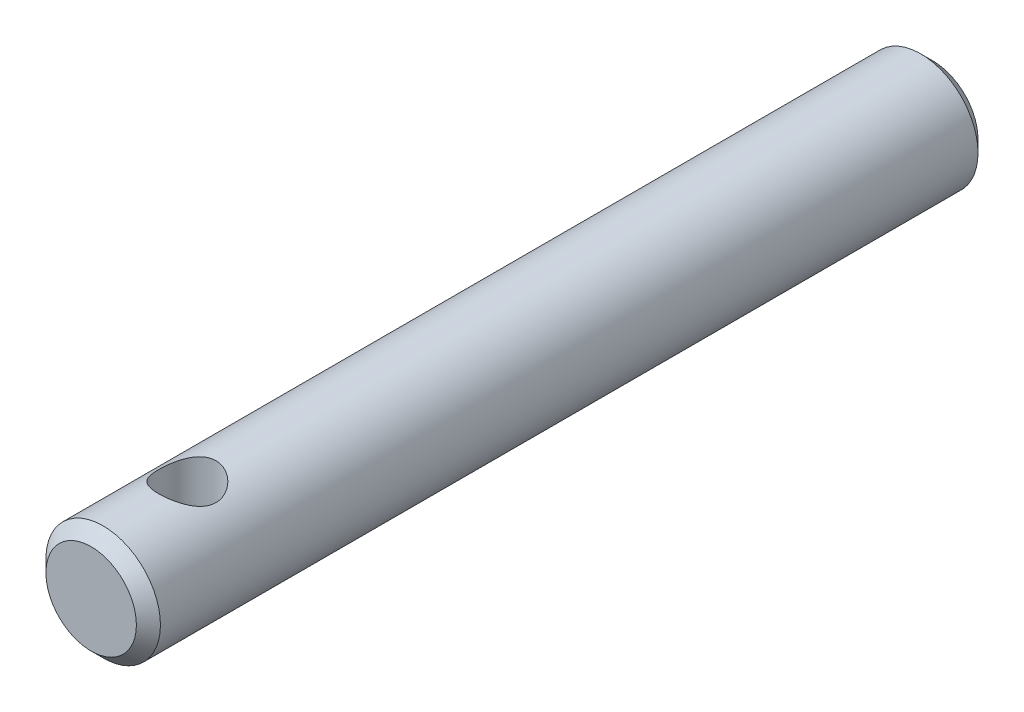
ISO-10303-21;
HEADER;
FILE_DESCRIPTION(('STEP AP214'),'2;1');
FILE_NAME('part.step','',(''),(''),'','','');
FILE_SCHEMA(('AUTOMOTIVE_DESIGN { 1 0 10303 214 1 1 1 1 }'));
ENDSEC;
DATA;
#1=APPLICATION_CONTEXT('core data for automotive mechanical design processes');
#2=APPLICATION_PROTOCOL_DEFINITION('international standard','automotive_design',2000,#1);
#3=PRODUCT_CONTEXT('',#1,'mechanical');
#4=PRODUCT('Part','Part','',(#3));
#5=PRODUCT_RELATED_PRODUCT_CATEGORY('part','',(#4));
#6=PRODUCT_DEFINITION_FORMATION('','',#4);
#7=PRODUCT_DEFINITION_CONTEXT('part definition',#1,'design');
#8=PRODUCT_DEFINITION('design','',#6,#7);
#9=PRODUCT_DEFINITION_SHAPE('','',#8);
#10=(LENGTH_UNIT() NAMED_UNIT(*) SI_UNIT(.MILLI.,.METRE.));
#11=(NAMED_UNIT(*) PLANE_ANGLE_UNIT() SI_UNIT($,.RADIAN.));
#12=(NAMED_UNIT(*) SI_UNIT($,.STERADIAN.) SOLID_ANGLE_UNIT());
#13=UNCERTAINTY_MEASURE_WITH_UNIT(LENGTH_MEASURE(1.E-05),#10,'distance_accuracy_value','');
#14=(GEOMETRIC_REPRESENTATION_CONTEXT(3) GLOBAL_UNCERTAINTY_ASSIGNED_CONTEXT((#13)) GLOBAL_UNIT_ASSIGNED_CONTEXT((#10,
#11,#12)) REPRESENTATION_CONTEXT('',''));
#15=CARTESIAN_POINT('',(0.,0.,0.));
#16=DIRECTION('',(0.,0.,1.));
#17=DIRECTION('',(1.,0.,0.));
#18=AXIS2_PLACEMENT_3D('',#15,#16,#17);
#19=CARTESIAN_POINT('',(0.,0.,17.5));
#20=DIRECTION('',(0.,0.,-1.));
#21=DIRECTION('',(-1.,0.,0.));
#22=AXIS2_PLACEMENT_3D('',#19,#20,#21);
#23=CYLINDRICAL_SURFACE('',#22,2.38125);
#24=CARTESIAN_POINT('',(0.,0.,-17.));
#25=DIRECTION('',(0.,0.,1.));
#26=DIRECTION('',(1.,0.,0.));
#27=AXIS2_PLACEMENT_3D('',#24,#25,#26);
#28=CIRCLE('',#27,2.38125);
#29=CARTESIAN_POINT('',(2.38125,0.,-17.));
#30=VERTEX_POINT('',#29);
#31=EDGE_CURVE('E42',#30,#30,#28,.T.);
#32=ORIENTED_EDGE('',*,*,#31,.T.);
#33=EDGE_LOOP('',(#32));
#34=FACE_BOUND('',#33,.T.);
#35=CARTESIAN_POINT('',(0.,0.,17.));
#36=DIRECTION('',(0.,0.,1.));
#37=DIRECTION('',(1.,0.,0.));
#38=AXIS2_PLACEMENT_3D('',#35,#36,#37);
#39=CIRCLE('',#38,2.38125);
#40=CARTESIAN_POINT('',(2.38125,0.,17.));
#41=VERTEX_POINT('',#40);
#42=EDGE_CURVE('E46',#41,#41,#39,.F.);
#43=ORIENTED_EDGE('',*,*,#42,.T.);
#44=EDGE_LOOP('',(#43));
#45=FACE_BOUND('',#44,.T.);
#46=CARTESIAN_POINT('',(0.,-2.38125,14.690625));
#47=CARTESIAN_POINT('',(0.0625934933908994,-2.38124658771817,14.6906210681758));
#48=CARTESIAN_POINT('',(0.12526160776547,-2.37875553370113,14.6856600066895));
#49=CARTESIAN_POINT('',(0.248745655116468,-2.36903604532025,14.6660351643441));
#50=CARTESIAN_POINT('',(0.309557840743265,-2.36179861446384,14.6513529570872));
#51=CARTESIAN_POINT('',(0.427355251873435,-2.34334382664568,14.6130036216156));
#52=CARTESIAN_POINT('',(0.484354349749463,-2.33214194770735,14.5893714112547));
#53=CARTESIAN_POINT('',(0.593493959385318,-2.30678565164099,14.5339737289374));
#54=CARTESIAN_POINT('',(0.645634853781904,-2.29263146732422,14.5022088982537));
#55=CARTESIAN_POINT('',(0.747126495522785,-2.26166669988499,14.4292622748316));
#56=CARTESIAN_POINT('',(0.796117610742265,-2.24474721461222,14.3876270356553));
#57=CARTESIAN_POINT('',(0.886753026544745,-2.2105140207503,14.2970978637715));
#58=CARTESIAN_POINT('',(0.928391728636494,-2.19320002298882,14.2481984514834));
#59=CARTESIAN_POINT('',(1.00637816303611,-2.15859063769342,14.1399807619737));
#60=CARTESIAN_POINT('',(1.04206516514117,-2.14140081986313,14.0801485829069));
#61=CARTESIAN_POINT('',(1.10271904514173,-2.11081118475794,13.9543813905914));
#62=CARTESIAN_POINT('',(1.12769358094429,-2.09740866244572,13.8884507779895));
#63=CARTESIAN_POINT('',(1.16458893898079,-2.07713897941891,13.756383108857));
#64=CARTESIAN_POINT('',(1.1772017235864,-2.06992860854359,13.6904946992573));
#65=CARTESIAN_POINT('',(1.19113338890835,-2.06194687719966,13.5571751962688));
#66=CARTESIAN_POINT('',(1.19246343021919,-2.06116915374353,13.4897456935253));
#67=CARTESIAN_POINT('',(1.18429955128951,-2.06586451337537,13.3639282022995));
#68=CARTESIAN_POINT('',(1.17608099119853,-2.07060121735085,13.3054232628251));
#69=CARTESIAN_POINT('',(1.15126275778341,-2.08450134836241,13.1907686016527));
#70=CARTESIAN_POINT('',(1.13466041470314,-2.09366618546584,13.1346196363709));
#71=CARTESIAN_POINT('',(1.09324351977209,-2.1155915160392,13.024667814039));
#72=CARTESIAN_POINT('',(1.06824668928498,-2.12843079040573,12.9709500689457));
#73=CARTESIAN_POINT('',(1.01089025937972,-2.15626240722546,12.868213545385));
#74=CARTESIAN_POINT('',(0.97852735278922,-2.17125571566415,12.8191968916761));
#75=CARTESIAN_POINT('',(0.90257239663054,-2.204003536286,12.7207106334526));
#76=CARTESIAN_POINT('',(0.858076839495927,-2.22186710625626,12.6719716598984));
#77=CARTESIAN_POINT('',(0.761470860938949,-2.25680138992047,12.5823431422402));
#78=CARTESIAN_POINT('',(0.709356821108759,-2.27387172175947,12.5414573494847));
#79=CARTESIAN_POINT('',(0.595927464756045,-2.30626428608779,12.4669117598365));
#80=CARTESIAN_POINT('',(0.534297244998046,-2.3214685301789,12.4336756874943));
#81=CARTESIAN_POINT('',(0.405367587816349,-2.34741102209979,12.3783157247957));
#82=CARTESIAN_POINT('',(0.338072701740845,-2.35815281492167,12.3561830109663));
#83=CARTESIAN_POINT('',(0.205700104133523,-2.37320534860897,12.3254777224498));
#84=CARTESIAN_POINT('',(0.140900384809099,-2.37797504664999,12.315933872439));
#85=CARTESIAN_POINT('',(0.0104532111896996,-2.38211931649743,12.307631054493));
#86=CARTESIAN_POINT('',(-0.0551938267826011,-2.38149644415063,12.3088669774105));
#87=CARTESIAN_POINT('',(-0.180061757270824,-2.37519200776753,12.3215273383986));
#88=CARTESIAN_POINT('',(-0.239386357709477,-2.36990626897501,12.3321546717817));
#89=CARTESIAN_POINT('',(-0.35529070614697,-2.35532022721706,12.3620459543501));
#90=CARTESIAN_POINT('',(-0.411870150775843,-2.34601948166815,12.3813108556835));
#91=CARTESIAN_POINT('',(-0.522551749435383,-2.323912493394,12.428435674097));
#92=CARTESIAN_POINT('',(-0.576536816435453,-2.31101362357334,12.4565255940453));
#93=CARTESIAN_POINT('',(-0.679205558772779,-2.28295169421308,12.5202436596286));
#94=CARTESIAN_POINT('',(-0.727886962326195,-2.26778767095513,12.5558750165003));
#95=CARTESIAN_POINT('',(-0.823635905061684,-2.23490101029919,12.637702256412));
#96=CARTESIAN_POINT('',(-0.870075505159961,-2.21707334772676,12.6845919777525));
#97=CARTESIAN_POINT('',(-0.954710182325451,-2.18196785003363,12.78553588323));
#98=CARTESIAN_POINT('',(-0.992899556088158,-2.1646904022613,12.8395949820907));
#99=CARTESIAN_POINT('',(-1.06168973569882,-2.13182825744162,12.9566507257822));
#100=CARTESIAN_POINT('',(-1.0918334810305,-2.11636605630571,13.0199534138296));
#101=CARTESIAN_POINT('',(-1.14071736472268,-2.090428799133,13.1517541743464));
#102=CARTESIAN_POINT('',(-1.15947219672864,-2.07994732092736,13.2202454237405));
#103=CARTESIAN_POINT('',(-1.18331657161977,-2.06646662138444,13.3534462340944));
#104=CARTESIAN_POINT('',(-1.18954509883978,-2.06284572182647,13.4178876579889));
#105=CARTESIAN_POINT('',(-1.19144552443462,-2.06175000375602,13.5469666643501));
#106=CARTESIAN_POINT('',(-1.18712199863718,-2.06427252119055,13.6116041496554));
#107=CARTESIAN_POINT('',(-1.16910579328329,-2.07451954503311,13.7327475440116));
#108=CARTESIAN_POINT('',(-1.1563448992644,-2.081725593681,13.7894414972657));
#109=CARTESIAN_POINT('',(-1.12296816088622,-2.09991741148739,13.89982154219));
#110=CARTESIAN_POINT('',(-1.10234978978715,-2.11090439637645,13.9535066599283));
#111=CARTESIAN_POINT('',(-1.05229312174863,-2.13632093965266,14.0603377132059));
#112=CARTESIAN_POINT('',(-1.02235532346272,-2.15093219477965,14.113205095616));
#113=CARTESIAN_POINT('',(-0.955061000604868,-2.18164566727434,14.21351124464));
#114=CARTESIAN_POINT('',(-0.917700616381016,-2.19774865799103,14.2609471666486));
#115=CARTESIAN_POINT('',(-0.831298335810088,-2.23197328511557,14.3550377977445));
#116=CARTESIAN_POINT('',(-0.781388641146484,-2.25010245755217,14.4008972437497));
#117=CARTESIAN_POINT('',(-0.67407806615602,-2.28454448778714,14.4837693646388));
#118=CARTESIAN_POINT('',(-0.616673173627609,-2.30085636405198,14.5207772710044));
#119=CARTESIAN_POINT('',(-0.495218557463749,-2.33002942662264,14.5849407944138));
#120=CARTESIAN_POINT('',(-0.43112472187215,-2.34286539970214,14.6120249017055));
#121=CARTESIAN_POINT('',(-0.298539814353396,-2.36340659560876,14.6546778499285));
#122=CARTESIAN_POINT('',(-0.230061848926332,-2.37112639390897,14.6702794176315));
#123=CARTESIAN_POINT('',(-0.134066692531779,-2.37762409336193,14.6833591050622));
#124=CARTESIAN_POINT('',(-0.107348987707653,-2.37898025606987,14.6860799567782));
#125=CARTESIAN_POINT('',(-0.0537587806828968,-2.3807939546427,14.6897137736309));
#126=CARTESIAN_POINT('',(-0.0268862742301633,-2.38125146570418,14.6906266888673));
#127=CARTESIAN_POINT('',(0.,-2.38125,14.690625));
#128=B_SPLINE_CURVE_WITH_KNOTS('',3,(#46,#47,#48,#49,#50,#51,#52,#53,#54,#55,#56,#57,#58,#59,
#60,#61,#62,#63,#64,#65,#66,#67,#68,#69,#70,#71,#72,#73,#74,#75,#76,#77,#78,#79,#80,#81,#82,#83,
#84,#85,#86,#87,#88,#89,#90,#91,#92,#93,#94,#95,#96,#97,#98,#99,#100,#101,#102,#103,#104,#105,
#106,#107,#108,#109,#110,#111,#112,#113,#114,#115,#116,#117,#118,#119,#120,#121,#122,#123,#124,
#125,#126,#127),.UNSPECIFIED.,.T.,.F.,(4,2,2,2,2,2,2,2,2,2,2,2,2,2,2,2,2,2,2,2,2,2,2,2,2,2,2,2,
2,2,2,2,2,2,2,2,2,2,2,2,4),(0.,0.187671381491035,0.375699515747514,0.56300150388302,
0.75028872744243,0.948906406473724,1.14767467670684,1.36185743031615,1.57588681716391,
1.77710320704461,1.97812053569865,2.15509926337347,2.33213438424011,2.51329317200605,
2.69453345625451,2.89875445775649,3.10307277131561,3.31687910824068,3.53051527011183,
3.72645730217446,3.92230647121476,4.10297598058852,4.28366541066828,4.46952119208217,
4.65545627297242,4.85965036423511,5.06398516445249,5.27821543446362,5.49216872029489,
5.68558331740251,5.87891405645819,6.0538272319698,6.22879670208067,6.41552156348466,
6.60234377481072,6.81186617152194,7.02150118957732,7.2326184126742,7.44313156831557,
7.52374130413946,7.60435326481739),.UNSPECIFIED.);
#129=CARTESIAN_POINT('',(0.,-2.38125,14.690625));
#130=VERTEX_POINT('',#129);
#131=EDGE_CURVE('E51',#130,#130,#128,.T.);
#132=ORIENTED_EDGE('',*,*,#131,.T.);
#133=EDGE_LOOP('',(#132));
#134=FACE_BOUND('',#133,.T.);
#135=CARTESIAN_POINT('',(0.,2.38125,14.690625));
#136=CARTESIAN_POINT('',(-0.0625934933908994,2.38124658771817,14.6906210681758));
#137=CARTESIAN_POINT('',(-0.12526160776547,2.37875553370113,14.6856600066895));
#138=CARTESIAN_POINT('',(-0.248745655116468,2.36903604532025,14.6660351643441));
#139=CARTESIAN_POINT('',(-0.309557840743265,2.36179861446384,14.6513529570872));
#140=CARTESIAN_POINT('',(-0.427355251873435,2.34334382664568,14.6130036216156));
#141=CARTESIAN_POINT('',(-0.484354349749463,2.33214194770735,14.5893714112547));
#142=CARTESIAN_POINT('',(-0.593493959385318,2.30678565164099,14.5339737289374));
#143=CARTESIAN_POINT('',(-0.645634853781904,2.29263146732422,14.5022088982537));
#144=CARTESIAN_POINT('',(-0.747126495522785,2.26166669988499,14.4292622748316));
#145=CARTESIAN_POINT('',(-0.796117610742265,2.24474721461222,14.3876270356553));
#146=CARTESIAN_POINT('',(-0.886753026544745,2.2105140207503,14.2970978637715));
#147=CARTESIAN_POINT('',(-0.928391728636494,2.19320002298882,14.2481984514834));
#148=CARTESIAN_POINT('',(-1.00637816303611,2.15859063769342,14.1399807619737));
#149=CARTESIAN_POINT('',(-1.04206516514117,2.14140081986313,14.0801485829069));
#150=CARTESIAN_POINT('',(-1.10271904514173,2.11081118475794,13.9543813905914));
#151=CARTESIAN_POINT('',(-1.12769358094429,2.09740866244572,13.8884507779895));
#152=CARTESIAN_POINT('',(-1.16458893898079,2.07713897941891,13.756383108857));
#153=CARTESIAN_POINT('',(-1.1772017235864,2.06992860854359,13.6904946992573));
#154=CARTESIAN_POINT('',(-1.19113338890835,2.06194687719966,13.5571751962688));
#155=CARTESIAN_POINT('',(-1.19246343021919,2.06116915374353,13.4897456935253));
#156=CARTESIAN_POINT('',(-1.18429955128951,2.06586451337537,13.3639282022995));
#157=CARTESIAN_POINT('',(-1.17608099119853,2.07060121735085,13.3054232628251));
#158=CARTESIAN_POINT('',(-1.15126275778341,2.08450134836241,13.1907686016527));
#159=CARTESIAN_POINT('',(-1.13466041470314,2.09366618546584,13.1346196363709));
#160=CARTESIAN_POINT('',(-1.09324351977209,2.1155915160392,13.024667814039));
#161=CARTESIAN_POINT('',(-1.06824668928498,2.12843079040573,12.9709500689457));
#162=CARTESIAN_POINT('',(-1.01089025937972,2.15626240722546,12.868213545385));
#163=CARTESIAN_POINT('',(-0.97852735278922,2.17125571566415,12.8191968916761));
#164=CARTESIAN_POINT('',(-0.90257239663054,2.204003536286,12.7207106334526));
#165=CARTESIAN_POINT('',(-0.858076839495927,2.22186710625626,12.6719716598984));
#166=CARTESIAN_POINT('',(-0.761470860938949,2.25680138992047,12.5823431422402));
#167=CARTESIAN_POINT('',(-0.709356821108759,2.27387172175947,12.5414573494847));
#168=CARTESIAN_POINT('',(-0.595927464756045,2.30626428608779,12.4669117598365));
#169=CARTESIAN_POINT('',(-0.534297244998046,2.3214685301789,12.4336756874943));
#170=CARTESIAN_POINT('',(-0.405367587816349,2.34741102209979,12.3783157247957));
#171=CARTESIAN_POINT('',(-0.338072701740845,2.35815281492167,12.3561830109663));
#172=CARTESIAN_POINT('',(-0.205700104133523,2.37320534860897,12.3254777224498));
#173=CARTESIAN_POINT('',(-0.140900384809099,2.37797504664999,12.315933872439));
#174=CARTESIAN_POINT('',(-0.0104532111896996,2.38211931649743,12.307631054493));
#175=CARTESIAN_POINT('',(0.0551938267826011,2.38149644415063,12.3088669774105));
#176=CARTESIAN_POINT('',(0.180061757270824,2.37519200776753,12.3215273383986));
#177=CARTESIAN_POINT('',(0.239386357709477,2.36990626897501,12.3321546717817));
#178=CARTESIAN_POINT('',(0.35529070614697,2.35532022721706,12.3620459543501));
#179=CARTESIAN_POINT('',(0.411870150775843,2.34601948166815,12.3813108556835));
#180=CARTESIAN_POINT('',(0.522551749435383,2.323912493394,12.428435674097));
#181=CARTESIAN_POINT('',(0.576536816435453,2.31101362357334,12.4565255940453));
#182=CARTESIAN_POINT('',(0.679205558772779,2.28295169421308,12.5202436596286));
#183=CARTESIAN_POINT('',(0.727886962326195,2.26778767095513,12.5558750165003));
#184=CARTESIAN_POINT('',(0.823635905061684,2.23490101029919,12.637702256412));
#185=CARTESIAN_POINT('',(0.870075505159961,2.21707334772676,12.6845919777525));
#186=CARTESIAN_POINT('',(0.954710182325451,2.18196785003363,12.78553588323));
#187=CARTESIAN_POINT('',(0.992899556088158,2.1646904022613,12.8395949820907));
#188=CARTESIAN_POINT('',(1.06168973569882,2.13182825744162,12.9566507257822));
#189=CARTESIAN_POINT('',(1.0918334810305,2.11636605630571,13.0199534138296));
#190=CARTESIAN_POINT('',(1.14071736472268,2.090428799133,13.1517541743464));
#191=CARTESIAN_POINT('',(1.15947219672864,2.07994732092736,13.2202454237405));
#192=CARTESIAN_POINT('',(1.18331657161977,2.06646662138444,13.3534462340944));
#193=CARTESIAN_POINT('',(1.18954509883978,2.06284572182647,13.4178876579889));
#194=CARTESIAN_POINT('',(1.19144552443462,2.06175000375602,13.5469666643501));
#195=CARTESIAN_POINT('',(1.18712199863718,2.06427252119055,13.6116041496554));
#196=CARTESIAN_POINT('',(1.16910579328329,2.07451954503311,13.7327475440116));
#197=CARTESIAN_POINT('',(1.1563448992644,2.081725593681,13.7894414972657));
#198=CARTESIAN_POINT('',(1.12296816088622,2.09991741148739,13.89982154219));
#199=CARTESIAN_POINT('',(1.10234978978715,2.11090439637645,13.9535066599283));
#200=CARTESIAN_POINT('',(1.05229312174863,2.13632093965266,14.0603377132059));
#201=CARTESIAN_POINT('',(1.02235532346272,2.15093219477965,14.113205095616));
#202=CARTESIAN_POINT('',(0.955061000604868,2.18164566727434,14.21351124464));
#203=CARTESIAN_POINT('',(0.917700616381016,2.19774865799103,14.2609471666486));
#204=CARTESIAN_POINT('',(0.831298335810088,2.23197328511557,14.3550377977445));
#205=CARTESIAN_POINT('',(0.781388641146484,2.25010245755217,14.4008972437497));
#206=CARTESIAN_POINT('',(0.67407806615602,2.28454448778714,14.4837693646388));
#207=CARTESIAN_POINT('',(0.616673173627609,2.30085636405198,14.5207772710044));
#208=CARTESIAN_POINT('',(0.495218557463749,2.33002942662264,14.5849407944138));
#209=CARTESIAN_POINT('',(0.43112472187215,2.34286539970214,14.6120249017055));
#210=CARTESIAN_POINT('',(0.298539814353396,2.36340659560876,14.6546778499285));
#211=CARTESIAN_POINT('',(0.230061848926332,2.37112639390897,14.6702794176315));
#212=CARTESIAN_POINT('',(0.134066692531779,2.37762409336193,14.6833591050622));
#213=CARTESIAN_POINT('',(0.107348987707653,2.37898025606987,14.6860799567782));
#214=CARTESIAN_POINT('',(0.0537587806828968,2.3807939546427,14.6897137736309));
#215=CARTESIAN_POINT('',(0.0268862742301633,2.38125146570418,14.6906266888673));
#216=CARTESIAN_POINT('',(0.,2.38125,14.690625));
#217=B_SPLINE_CURVE_WITH_KNOTS('',3,(#135,#136,#137,#138,#139,#140,#141,#142,#143,#144,#145,
#146,#147,#148,#149,#150,#151,#152,#153,#154,#155,#156,#157,#158,#159,#160,#161,#162,#163,#164,
#165,#166,#167,#168,#169,#170,#171,#172,#173,#174,#175,#176,#177,#178,#179,#180,#181,#182,#183,
#184,#185,#186,#187,#188,#189,#190,#191,#192,#193,#194,#195,#196,#197,#198,#199,#200,#201,#202,
#203,#204,#205,#206,#207,#208,#209,#210,#211,#212,#213,#214,#215,#216),.UNSPECIFIED.,.T.,.F.,(4,
2,2,2,2,2,2,2,2,2,2,2,2,2,2,2,2,2,2,2,2,2,2,2,2,2,2,2,2,2,2,2,2,2,2,2,2,2,2,2,4),(0.,
0.187671381491035,0.375699515747514,0.56300150388302,0.75028872744243,0.948906406473724,
1.14767467670684,1.36185743031615,1.57588681716391,1.77710320704461,1.97812053569865,
2.15509926337347,2.33213438424011,2.51329317200605,2.69453345625451,2.89875445775649,
3.10307277131561,3.31687910824068,3.53051527011183,3.72645730217446,3.92230647121476,
4.10297598058852,4.28366541066828,4.46952119208217,4.65545627297242,4.85965036423511,
5.06398516445249,5.27821543446362,5.49216872029489,5.68558331740251,5.87891405645819,
6.0538272319698,6.22879670208067,6.41552156348466,6.60234377481072,6.81186617152194,
7.02150118957732,7.2326184126742,7.44313156831557,7.52374130413946,7.60435326481739),.UNSPECIFIED.);
#218=CARTESIAN_POINT('',(0.,2.38125,14.690625));
#219=VERTEX_POINT('',#218);
#220=EDGE_CURVE('E59',#219,#219,#217,.T.);
#221=ORIENTED_EDGE('',*,*,#220,.T.);
#222=EDGE_LOOP('',(#221));
#223=FACE_BOUND('',#222,.T.);
#224=ADVANCED_FACE('F31',(#34,#45,#134,#223),#23,.T.);
#225=CARTESIAN_POINT('',(0.,0.,17.5));
#226=DIRECTION('',(0.,0.,1.));
#227=DIRECTION('',(1.,0.,0.));
#228=AXIS2_PLACEMENT_3D('',#225,#226,#227);
#229=PLANE('',#228);
#230=CARTESIAN_POINT('',(0.,0.,17.5));
#231=DIRECTION('',(0.,0.,1.));
#232=DIRECTION('',(1.,0.,0.));
#233=AXIS2_PLACEMENT_3D('',#230,#231,#232);
#234=CIRCLE('',#233,1.88124999999999);
#235=CARTESIAN_POINT('',(1.88124999999999,0.,17.5));
#236=VERTEX_POINT('',#235);
#237=EDGE_CURVE('E10',#236,#236,#234,.T.);
#238=ORIENTED_EDGE('',*,*,#237,.T.);
#239=EDGE_LOOP('',(#238));
#240=FACE_BOUND('',#239,.T.);
#241=ADVANCED_FACE('F72',(#240),#229,.T.);
#242=CARTESIAN_POINT('',(0.,0.,-17.5));
#243=DIRECTION('',(0.,0.,1.));
#244=DIRECTION('',(1.,0.,0.));
#245=AXIS2_PLACEMENT_3D('',#242,#243,#244);
#246=PLANE('',#245);
#247=CARTESIAN_POINT('',(0.,0.,-17.5));
#248=DIRECTION('',(0.,0.,1.));
#249=DIRECTION('',(1.,0.,0.));
#250=AXIS2_PLACEMENT_3D('',#247,#248,#249);
#251=CIRCLE('',#250,1.88125);
#252=CARTESIAN_POINT('',(1.88125,0.,-17.5));
#253=VERTEX_POINT('',#252);
#254=EDGE_CURVE('E38',#253,#253,#251,.F.);
#255=ORIENTED_EDGE('',*,*,#254,.T.);
#256=EDGE_LOOP('',(#255));
#257=FACE_BOUND('',#256,.T.);
#258=ADVANCED_FACE('F70',(#257),#246,.F.);
#259=CARTESIAN_POINT('',(0.,-2.38125,13.5));
#260=DIRECTION('',(0.,1.,0.));
#261=DIRECTION('',(0.,0.,1.));
#262=AXIS2_PLACEMENT_3D('',#259,#260,#261);
#263=CYLINDRICAL_SURFACE('',#262,1.190625);
#264=ORIENTED_EDGE('',*,*,#220,.F.);
#265=EDGE_LOOP('',(#264));
#266=FACE_BOUND('',#265,.T.);
#267=ORIENTED_EDGE('',*,*,#131,.F.);
#268=EDGE_LOOP('',(#267));
#269=FACE_BOUND('',#268,.T.);
#270=ADVANCED_FACE('F65',(#266,#269),#263,.F.);
#271=CARTESIAN_POINT('',(0.,0.,-17.));
#272=DIRECTION('',(0.,0.,1.));
#273=DIRECTION('',(1.,0.,0.));
#274=AXIS2_PLACEMENT_3D('',#271,#272,#273);
#275=CONICAL_SURFACE('',#274,2.38125,0.785398163397452);
#276=ORIENTED_EDGE('',*,*,#254,.F.);
#277=EDGE_LOOP('',(#276));
#278=FACE_BOUND('',#277,.T.);
#279=ORIENTED_EDGE('',*,*,#31,.F.);
#280=EDGE_LOOP('',(#279));
#281=FACE_BOUND('',#280,.T.);
#282=ADVANCED_FACE('F69',(#278,#281),#275,.T.);
#283=CARTESIAN_POINT('',(0.,0.,17.5));
#284=DIRECTION('',(0.,0.,-1.));
#285=DIRECTION('',(-1.,0.,0.));
#286=AXIS2_PLACEMENT_3D('',#283,#284,#285);
#287=CONICAL_SURFACE('',#286,1.88124999999999,0.785398163397448);
#288=ORIENTED_EDGE('',*,*,#42,.F.);
#289=EDGE_LOOP('',(#288));
#290=FACE_BOUND('',#289,.T.);
#291=ORIENTED_EDGE('',*,*,#237,.F.);
#292=EDGE_LOOP('',(#291));
#293=FACE_BOUND('',#292,.T.);
#294=ADVANCED_FACE('F33',(#290,#293),#287,.T.);
#295=CLOSED_SHELL('',(#224,#241,#258,#270,#282,#294));
#296=MANIFOLD_SOLID_BREP('B2',#295);
#297=ADVANCED_BREP_SHAPE_REPRESENTATION('',(#18,#296),#14);
#298=SHAPE_DEFINITION_REPRESENTATION(#9,#297);
ENDSEC;
END-ISO-10303-21;
